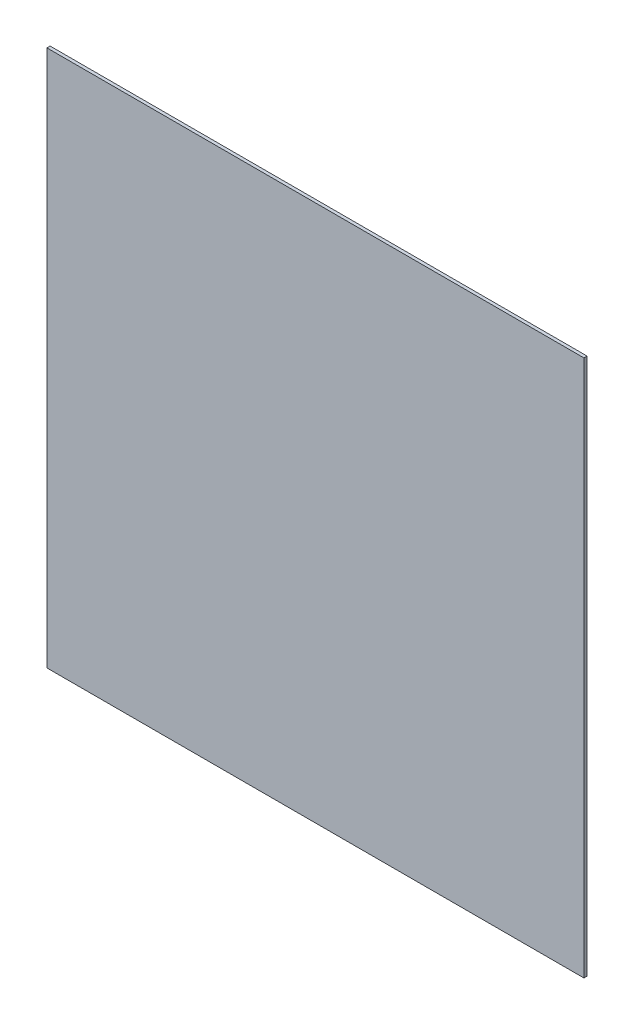
ISO-10303-21;
HEADER;
FILE_DESCRIPTION(('STEP AP214'),'2;1');
FILE_NAME('part.step','',(''),(''),'','','');
FILE_SCHEMA(('AUTOMOTIVE_DESIGN { 1 0 10303 214 1 1 1 1 }'));
ENDSEC;
DATA;
#1=APPLICATION_CONTEXT('core data for automotive mechanical design processes');
#2=APPLICATION_PROTOCOL_DEFINITION('international standard','automotive_design',2000,#1);
#3=PRODUCT_CONTEXT('',#1,'mechanical');
#4=PRODUCT('Part','Part','',(#3));
#5=PRODUCT_RELATED_PRODUCT_CATEGORY('part','',(#4));
#6=PRODUCT_DEFINITION_FORMATION('','',#4);
#7=PRODUCT_DEFINITION_CONTEXT('part definition',#1,'design');
#8=PRODUCT_DEFINITION('design','',#6,#7);
#9=PRODUCT_DEFINITION_SHAPE('','',#8);
#10=(LENGTH_UNIT() NAMED_UNIT(*) SI_UNIT(.MILLI.,.METRE.));
#11=(NAMED_UNIT(*) PLANE_ANGLE_UNIT() SI_UNIT($,.RADIAN.));
#12=(NAMED_UNIT(*) SI_UNIT($,.STERADIAN.) SOLID_ANGLE_UNIT());
#13=UNCERTAINTY_MEASURE_WITH_UNIT(LENGTH_MEASURE(1.E-05),#10,'distance_accuracy_value','');
#14=(GEOMETRIC_REPRESENTATION_CONTEXT(3) GLOBAL_UNCERTAINTY_ASSIGNED_CONTEXT((#13)) GLOBAL_UNIT_ASSIGNED_CONTEXT((#10,
#11,#12)) REPRESENTATION_CONTEXT('',''));
#15=CARTESIAN_POINT('',(0.,0.,0.));
#16=DIRECTION('',(0.,0.,1.));
#17=DIRECTION('',(1.,0.,0.));
#18=AXIS2_PLACEMENT_3D('',#15,#16,#17);
#19=CARTESIAN_POINT('',(-60.4482829781526,-7.83000525053503,6.70770612576134));
#20=DIRECTION('',(1.,0.,0.));
#21=DIRECTION('',(0.,1.,0.));
#22=AXIS2_PLACEMENT_3D('',#19,#20,#21);
#23=PLANE('',#22);
#24=DIRECTION('',(0.,-1.,0.));
#25=VECTOR('',#24,1.);
#26=CARTESIAN_POINT('',(-60.4482829781526,-7.83000525053503,6.40770612576134));
#27=LINE('',#26,#25);
#28=CARTESIAN_POINT('',(-60.4482829781527,42.969994749465,6.40770612576134));
#29=VERTEX_POINT('',#28);
#30=CARTESIAN_POINT('',(-60.4482829781526,-7.83000525053503,6.40770612576134));
#31=VERTEX_POINT('',#30);
#32=EDGE_CURVE('E79',#29,#31,#27,.T.);
#33=ORIENTED_EDGE('',*,*,#32,.T.);
#34=DIRECTION('',(0.,0.,-1.));
#35=VECTOR('',#34,1.);
#36=CARTESIAN_POINT('',(-60.4482829781526,-7.83000525053503,6.70770612576134));
#37=LINE('',#36,#35);
#38=CARTESIAN_POINT('',(-60.4482829781526,-7.83000525053503,6.70770612576134));
#39=VERTEX_POINT('',#38);
#40=EDGE_CURVE('E11',#39,#31,#37,.T.);
#41=ORIENTED_EDGE('',*,*,#40,.F.);
#42=DIRECTION('',(0.,-1.,0.));
#43=VECTOR('',#42,1.);
#44=CARTESIAN_POINT('',(-60.4482829781526,-7.83000525053503,6.70770612576134));
#45=LINE('',#44,#43);
#46=CARTESIAN_POINT('',(-60.4482829781527,42.969994749465,6.70770612576134));
#47=VERTEX_POINT('',#46);
#48=EDGE_CURVE('E67',#47,#39,#45,.T.);
#49=ORIENTED_EDGE('',*,*,#48,.F.);
#50=DIRECTION('',(0.,0.,-1.));
#51=VECTOR('',#50,1.);
#52=CARTESIAN_POINT('',(-60.4482829781527,42.969994749465,6.70770612576134));
#53=LINE('',#52,#51);
#54=EDGE_CURVE('E75',#47,#29,#53,.T.);
#55=ORIENTED_EDGE('',*,*,#54,.T.);
#56=EDGE_LOOP('',(#33,#41,#49,#55));
#57=FACE_BOUND('',#56,.T.);
#58=ADVANCED_FACE('F16',(#57),#23,.F.);
#59=CARTESIAN_POINT('',(-60.4482829781526,-7.83000525053503,6.70770612576134));
#60=DIRECTION('',(0.,1.,0.));
#61=DIRECTION('',(0.,0.,1.));
#62=AXIS2_PLACEMENT_3D('',#59,#60,#61);
#63=PLANE('',#62);
#64=DIRECTION('',(1.,0.,0.));
#65=VECTOR('',#64,1.);
#66=CARTESIAN_POINT('',(-60.4482829781526,-7.83000525053503,6.40770612576134));
#67=LINE('',#66,#65);
#68=CARTESIAN_POINT('',(-9.64828297815265,-7.83000525053503,6.40770612576134));
#69=VERTEX_POINT('',#68);
#70=EDGE_CURVE('E71',#31,#69,#67,.T.);
#71=ORIENTED_EDGE('',*,*,#70,.T.);
#72=DIRECTION('',(0.,0.,-1.));
#73=VECTOR('',#72,1.);
#74=CARTESIAN_POINT('',(-9.64828297815265,-7.83000525053503,6.70770612576134));
#75=LINE('',#74,#73);
#76=CARTESIAN_POINT('',(-9.64828297815265,-7.83000525053503,6.70770612576134));
#77=VERTEX_POINT('',#76);
#78=EDGE_CURVE('E24',#77,#69,#75,.T.);
#79=ORIENTED_EDGE('',*,*,#78,.F.);
#80=DIRECTION('',(1.,0.,0.));
#81=VECTOR('',#80,1.);
#82=CARTESIAN_POINT('',(-60.4482829781526,-7.83000525053503,6.70770612576134));
#83=LINE('',#82,#81);
#84=EDGE_CURVE('E62',#39,#77,#83,.T.);
#85=ORIENTED_EDGE('',*,*,#84,.F.);
#86=ORIENTED_EDGE('',*,*,#40,.T.);
#87=EDGE_LOOP('',(#71,#79,#85,#86));
#88=FACE_BOUND('',#87,.T.);
#89=ADVANCED_FACE('F70',(#88),#63,.F.);
#90=CARTESIAN_POINT('',(-9.64828297815265,-7.83000525053503,6.70770612576134));
#91=DIRECTION('',(-1.,0.,0.));
#92=DIRECTION('',(0.,-1.,0.));
#93=AXIS2_PLACEMENT_3D('',#90,#91,#92);
#94=PLANE('',#93);
#95=DIRECTION('',(0.,1.,0.));
#96=VECTOR('',#95,1.);
#97=CARTESIAN_POINT('',(-9.64828297815265,-7.83000525053503,6.40770612576134));
#98=LINE('',#97,#96);
#99=CARTESIAN_POINT('',(-9.64828297815266,42.969994749465,6.40770612576134));
#100=VERTEX_POINT('',#99);
#101=EDGE_CURVE('E49',#69,#100,#98,.T.);
#102=ORIENTED_EDGE('',*,*,#101,.T.);
#103=DIRECTION('',(0.,0.,-1.));
#104=VECTOR('',#103,1.);
#105=CARTESIAN_POINT('',(-9.64828297815266,42.969994749465,6.70770612576134));
#106=LINE('',#105,#104);
#107=CARTESIAN_POINT('',(-9.64828297815266,42.969994749465,6.70770612576134));
#108=VERTEX_POINT('',#107);
#109=EDGE_CURVE('E72',#108,#100,#106,.T.);
#110=ORIENTED_EDGE('',*,*,#109,.F.);
#111=DIRECTION('',(0.,1.,0.));
#112=VECTOR('',#111,1.);
#113=CARTESIAN_POINT('',(-9.64828297815265,-7.83000525053503,6.70770612576134));
#114=LINE('',#113,#112);
#115=EDGE_CURVE('E65',#77,#108,#114,.T.);
#116=ORIENTED_EDGE('',*,*,#115,.F.);
#117=ORIENTED_EDGE('',*,*,#78,.T.);
#118=EDGE_LOOP('',(#102,#110,#116,#117));
#119=FACE_BOUND('',#118,.T.);
#120=ADVANCED_FACE('F73',(#119),#94,.F.);
#121=CARTESIAN_POINT('',(-60.4482829781527,42.969994749465,6.70770612576134));
#122=DIRECTION('',(0.,-1.,0.));
#123=DIRECTION('',(0.,0.,-1.));
#124=AXIS2_PLACEMENT_3D('',#121,#122,#123);
#125=PLANE('',#124);
#126=DIRECTION('',(-1.,0.,0.));
#127=VECTOR('',#126,1.);
#128=CARTESIAN_POINT('',(-60.4482829781527,42.969994749465,6.40770612576134));
#129=LINE('',#128,#127);
#130=EDGE_CURVE('E55',#100,#29,#129,.T.);
#131=ORIENTED_EDGE('',*,*,#130,.T.);
#132=ORIENTED_EDGE('',*,*,#54,.F.);
#133=DIRECTION('',(-1.,0.,0.));
#134=VECTOR('',#133,1.);
#135=CARTESIAN_POINT('',(-60.4482829781527,42.969994749465,6.70770612576134));
#136=LINE('',#135,#134);
#137=EDGE_CURVE('E32',#108,#47,#136,.T.);
#138=ORIENTED_EDGE('',*,*,#137,.F.);
#139=ORIENTED_EDGE('',*,*,#109,.T.);
#140=EDGE_LOOP('',(#131,#132,#138,#139));
#141=FACE_BOUND('',#140,.T.);
#142=ADVANCED_FACE('F86',(#141),#125,.F.);
#143=CARTESIAN_POINT('',(-60.4482829781527,42.969994749465,6.70770612576134));
#144=DIRECTION('',(0.,0.,-1.));
#145=DIRECTION('',(-1.,0.,0.));
#146=AXIS2_PLACEMENT_3D('',#143,#144,#145);
#147=PLANE('',#146);
#148=ORIENTED_EDGE('',*,*,#48,.T.);
#149=ORIENTED_EDGE('',*,*,#84,.T.);
#150=ORIENTED_EDGE('',*,*,#115,.T.);
#151=ORIENTED_EDGE('',*,*,#137,.T.);
#152=EDGE_LOOP('',(#148,#149,#150,#151));
#153=FACE_BOUND('',#152,.T.);
#154=ADVANCED_FACE('F63',(#153),#147,.F.);
#155=CARTESIAN_POINT('',(-60.4482829781527,42.969994749465,6.40770612576134));
#156=DIRECTION('',(0.,0.,-1.));
#157=DIRECTION('',(-1.,0.,0.));
#158=AXIS2_PLACEMENT_3D('',#155,#156,#157);
#159=PLANE('',#158);
#160=ORIENTED_EDGE('',*,*,#32,.F.);
#161=ORIENTED_EDGE('',*,*,#130,.F.);
#162=ORIENTED_EDGE('',*,*,#101,.F.);
#163=ORIENTED_EDGE('',*,*,#70,.F.);
#164=EDGE_LOOP('',(#160,#161,#162,#163));
#165=FACE_BOUND('',#164,.T.);
#166=ADVANCED_FACE('F89',(#165),#159,.T.);
#167=CLOSED_SHELL('',(#58,#89,#120,#142,#154,#166));
#168=MANIFOLD_SOLID_BREP('B1',#167);
#169=ADVANCED_BREP_SHAPE_REPRESENTATION('',(#18,#168),#14);
#170=SHAPE_DEFINITION_REPRESENTATION(#9,#169);
ENDSEC;
END-ISO-10303-21;
